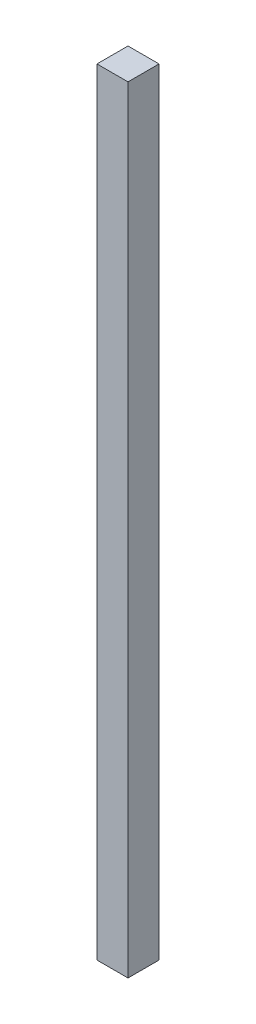
ISO-10303-21;
HEADER;
FILE_DESCRIPTION(('STEP AP214'),'2;1');
FILE_NAME('part.step','',(''),(''),'','','');
FILE_SCHEMA(('AUTOMOTIVE_DESIGN { 1 0 10303 214 1 1 1 1 }'));
ENDSEC;
DATA;
#1=APPLICATION_CONTEXT('core data for automotive mechanical design processes');
#2=APPLICATION_PROTOCOL_DEFINITION('international standard','automotive_design',2000,#1);
#3=PRODUCT_CONTEXT('',#1,'mechanical');
#4=PRODUCT('Part','Part','',(#3));
#5=PRODUCT_RELATED_PRODUCT_CATEGORY('part','',(#4));
#6=PRODUCT_DEFINITION_FORMATION('','',#4);
#7=PRODUCT_DEFINITION_CONTEXT('part definition',#1,'design');
#8=PRODUCT_DEFINITION('design','',#6,#7);
#9=PRODUCT_DEFINITION_SHAPE('','',#8);
#10=(LENGTH_UNIT() NAMED_UNIT(*) SI_UNIT(.MILLI.,.METRE.));
#11=(NAMED_UNIT(*) PLANE_ANGLE_UNIT() SI_UNIT($,.RADIAN.));
#12=(NAMED_UNIT(*) SI_UNIT($,.STERADIAN.) SOLID_ANGLE_UNIT());
#13=UNCERTAINTY_MEASURE_WITH_UNIT(LENGTH_MEASURE(1.E-05),#10,'distance_accuracy_value','');
#14=(GEOMETRIC_REPRESENTATION_CONTEXT(3) GLOBAL_UNCERTAINTY_ASSIGNED_CONTEXT((#13)) GLOBAL_UNIT_ASSIGNED_CONTEXT((#10,
#11,#12)) REPRESENTATION_CONTEXT('',''));
#15=CARTESIAN_POINT('',(0.,0.,0.));
#16=DIRECTION('',(0.,0.,1.));
#17=DIRECTION('',(1.,0.,0.));
#18=AXIS2_PLACEMENT_3D('',#15,#16,#17);
#19=CARTESIAN_POINT('',(0.,500.,0.));
#20=DIRECTION('',(1.,0.,0.));
#21=DIRECTION('',(0.,0.,-1.));
#22=AXIS2_PLACEMENT_3D('',#19,#20,#21);
#23=PLANE('',#22);
#24=DIRECTION('',(0.,0.,1.));
#25=VECTOR('',#24,1.);
#26=CARTESIAN_POINT('',(0.,0.,0.));
#27=LINE('',#26,#25);
#28=CARTESIAN_POINT('',(0.,0.,0.));
#29=VERTEX_POINT('',#28);
#30=CARTESIAN_POINT('',(0.,0.,20.));
#31=VERTEX_POINT('',#30);
#32=EDGE_CURVE('E95',#29,#31,#27,.T.);
#33=ORIENTED_EDGE('',*,*,#32,.T.);
#34=DIRECTION('',(0.,-1.,0.));
#35=VECTOR('',#34,1.);
#36=CARTESIAN_POINT('',(0.,500.,20.));
#37=LINE('',#36,#35);
#38=CARTESIAN_POINT('',(0.,500.,20.));
#39=VERTEX_POINT('',#38);
#40=EDGE_CURVE('E11',#39,#31,#37,.T.);
#41=ORIENTED_EDGE('',*,*,#40,.F.);
#42=DIRECTION('',(0.,0.,1.));
#43=VECTOR('',#42,1.);
#44=CARTESIAN_POINT('',(0.,500.,0.));
#45=LINE('',#44,#43);
#46=CARTESIAN_POINT('',(0.,500.,0.));
#47=VERTEX_POINT('',#46);
#48=EDGE_CURVE('E83',#47,#39,#45,.T.);
#49=ORIENTED_EDGE('',*,*,#48,.F.);
#50=DIRECTION('',(0.,-1.,0.));
#51=VECTOR('',#50,1.);
#52=CARTESIAN_POINT('',(0.,500.,0.));
#53=LINE('',#52,#51);
#54=EDGE_CURVE('E91',#47,#29,#53,.T.);
#55=ORIENTED_EDGE('',*,*,#54,.T.);
#56=EDGE_LOOP('',(#33,#41,#49,#55));
#57=FACE_BOUND('',#56,.T.);
#58=ADVANCED_FACE('F32',(#57),#23,.F.);
#59=CARTESIAN_POINT('',(0.,500.,20.));
#60=DIRECTION('',(0.,0.,-1.));
#61=DIRECTION('',(-1.,0.,0.));
#62=AXIS2_PLACEMENT_3D('',#59,#60,#61);
#63=PLANE('',#62);
#64=DIRECTION('',(1.,0.,0.));
#65=VECTOR('',#64,1.);
#66=CARTESIAN_POINT('',(0.,0.,20.));
#67=LINE('',#66,#65);
#68=CARTESIAN_POINT('',(20.,0.,20.));
#69=VERTEX_POINT('',#68);
#70=EDGE_CURVE('E87',#31,#69,#67,.T.);
#71=ORIENTED_EDGE('',*,*,#70,.T.);
#72=DIRECTION('',(0.,-1.,0.));
#73=VECTOR('',#72,1.);
#74=CARTESIAN_POINT('',(20.,500.,20.));
#75=LINE('',#74,#73);
#76=CARTESIAN_POINT('',(20.,500.,20.));
#77=VERTEX_POINT('',#76);
#78=EDGE_CURVE('E40',#77,#69,#75,.T.);
#79=ORIENTED_EDGE('',*,*,#78,.F.);
#80=DIRECTION('',(1.,0.,0.));
#81=VECTOR('',#80,1.);
#82=CARTESIAN_POINT('',(0.,500.,20.));
#83=LINE('',#82,#81);
#84=EDGE_CURVE('E78',#39,#77,#83,.T.);
#85=ORIENTED_EDGE('',*,*,#84,.F.);
#86=ORIENTED_EDGE('',*,*,#40,.T.);
#87=EDGE_LOOP('',(#71,#79,#85,#86));
#88=FACE_BOUND('',#87,.T.);
#89=ADVANCED_FACE('F86',(#88),#63,.F.);
#90=CARTESIAN_POINT('',(20.,500.,0.));
#91=DIRECTION('',(-1.,0.,0.));
#92=DIRECTION('',(0.,0.,1.));
#93=AXIS2_PLACEMENT_3D('',#90,#91,#92);
#94=PLANE('',#93);
#95=DIRECTION('',(0.,0.,-1.));
#96=VECTOR('',#95,1.);
#97=CARTESIAN_POINT('',(20.,0.,0.));
#98=LINE('',#97,#96);
#99=CARTESIAN_POINT('',(20.,0.,0.));
#100=VERTEX_POINT('',#99);
#101=EDGE_CURVE('E65',#69,#100,#98,.T.);
#102=ORIENTED_EDGE('',*,*,#101,.T.);
#103=DIRECTION('',(0.,-1.,0.));
#104=VECTOR('',#103,1.);
#105=CARTESIAN_POINT('',(20.,500.,0.));
#106=LINE('',#105,#104);
#107=CARTESIAN_POINT('',(20.,500.,0.));
#108=VERTEX_POINT('',#107);
#109=EDGE_CURVE('E88',#108,#100,#106,.T.);
#110=ORIENTED_EDGE('',*,*,#109,.F.);
#111=DIRECTION('',(0.,0.,-1.));
#112=VECTOR('',#111,1.);
#113=CARTESIAN_POINT('',(20.,500.,0.));
#114=LINE('',#113,#112);
#115=EDGE_CURVE('E81',#77,#108,#114,.T.);
#116=ORIENTED_EDGE('',*,*,#115,.F.);
#117=ORIENTED_EDGE('',*,*,#78,.T.);
#118=EDGE_LOOP('',(#102,#110,#116,#117));
#119=FACE_BOUND('',#118,.T.);
#120=ADVANCED_FACE('F89',(#119),#94,.F.);
#121=CARTESIAN_POINT('',(0.,500.,0.));
#122=DIRECTION('',(0.,0.,1.));
#123=DIRECTION('',(1.,0.,0.));
#124=AXIS2_PLACEMENT_3D('',#121,#122,#123);
#125=PLANE('',#124);
#126=DIRECTION('',(-1.,0.,0.));
#127=VECTOR('',#126,1.);
#128=CARTESIAN_POINT('',(0.,0.,0.));
#129=LINE('',#128,#127);
#130=EDGE_CURVE('E71',#100,#29,#129,.T.);
#131=ORIENTED_EDGE('',*,*,#130,.T.);
#132=ORIENTED_EDGE('',*,*,#54,.F.);
#133=DIRECTION('',(-1.,0.,0.));
#134=VECTOR('',#133,1.);
#135=CARTESIAN_POINT('',(0.,500.,0.));
#136=LINE('',#135,#134);
#137=EDGE_CURVE('E48',#108,#47,#136,.T.);
#138=ORIENTED_EDGE('',*,*,#137,.F.);
#139=ORIENTED_EDGE('',*,*,#109,.T.);
#140=EDGE_LOOP('',(#131,#132,#138,#139));
#141=FACE_BOUND('',#140,.T.);
#142=ADVANCED_FACE('F102',(#141),#125,.F.);
#143=CARTESIAN_POINT('',(0.,500.,0.));
#144=DIRECTION('',(0.,1.,0.));
#145=DIRECTION('',(0.,0.,1.));
#146=AXIS2_PLACEMENT_3D('',#143,#144,#145);
#147=PLANE('',#146);
#148=ORIENTED_EDGE('',*,*,#48,.T.);
#149=ORIENTED_EDGE('',*,*,#84,.T.);
#150=ORIENTED_EDGE('',*,*,#115,.T.);
#151=ORIENTED_EDGE('',*,*,#137,.T.);
#152=EDGE_LOOP('',(#148,#149,#150,#151));
#153=FACE_BOUND('',#152,.T.);
#154=ADVANCED_FACE('F79',(#153),#147,.T.);
#155=CARTESIAN_POINT('',(0.,0.,0.));
#156=DIRECTION('',(0.,1.,0.));
#157=DIRECTION('',(0.,0.,1.));
#158=AXIS2_PLACEMENT_3D('',#155,#156,#157);
#159=PLANE('',#158);
#160=ORIENTED_EDGE('',*,*,#32,.F.);
#161=ORIENTED_EDGE('',*,*,#130,.F.);
#162=ORIENTED_EDGE('',*,*,#101,.F.);
#163=ORIENTED_EDGE('',*,*,#70,.F.);
#164=EDGE_LOOP('',(#160,#161,#162,#163));
#165=FACE_BOUND('',#164,.T.);
#166=ADVANCED_FACE('F105',(#165),#159,.F.);
#167=CLOSED_SHELL('',(#58,#89,#120,#142,#154,#166));
#168=MANIFOLD_SOLID_BREP('B2',#167);
#169=ADVANCED_BREP_SHAPE_REPRESENTATION('',(#18,#168),#14);
#170=SHAPE_DEFINITION_REPRESENTATION(#9,#169);
ENDSEC;
END-ISO-10303-21;
